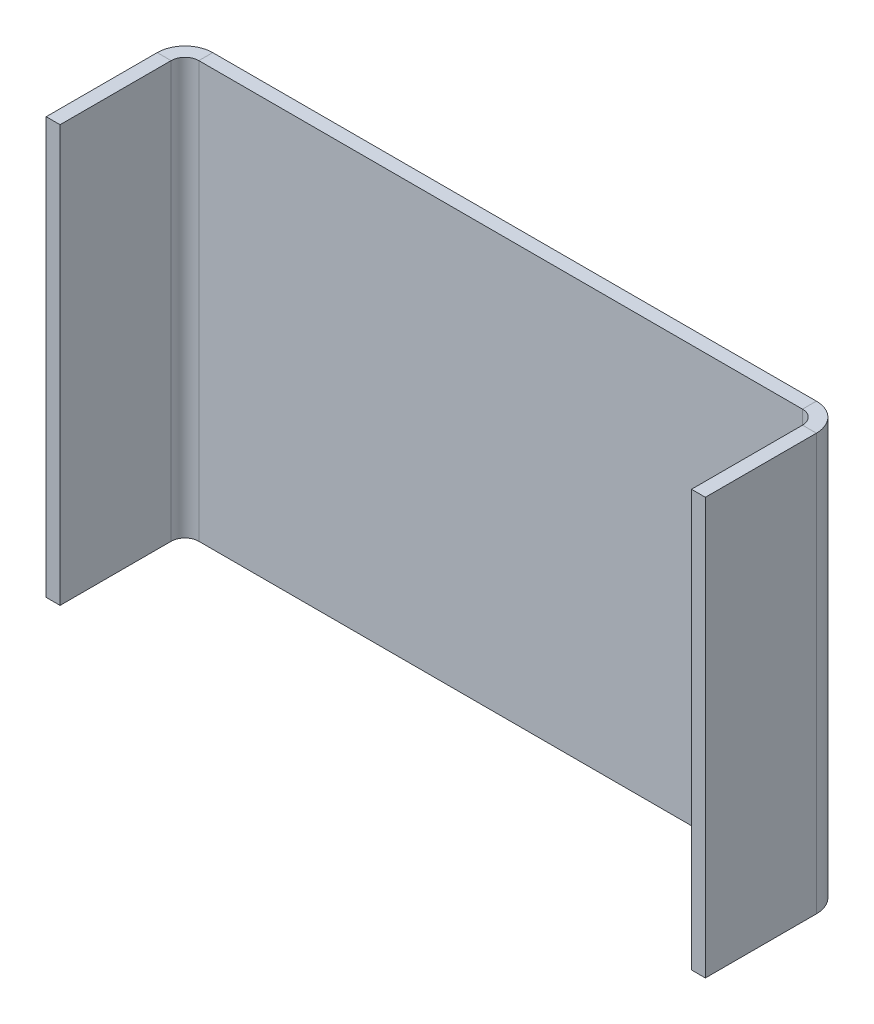
ISO-10303-21;
HEADER;
FILE_DESCRIPTION(('STEP AP214'),'2;1');
FILE_NAME('part.step','',(''),(''),'','','');
FILE_SCHEMA(('AUTOMOTIVE_DESIGN { 1 0 10303 214 1 1 1 1 }'));
ENDSEC;
DATA;
#1=APPLICATION_CONTEXT('core data for automotive mechanical design processes');
#2=APPLICATION_PROTOCOL_DEFINITION('international standard','automotive_design',2000,#1);
#3=PRODUCT_CONTEXT('',#1,'mechanical');
#4=PRODUCT('Part','Part','',(#3));
#5=PRODUCT_RELATED_PRODUCT_CATEGORY('part','',(#4));
#6=PRODUCT_DEFINITION_FORMATION('','',#4);
#7=PRODUCT_DEFINITION_CONTEXT('part definition',#1,'design');
#8=PRODUCT_DEFINITION('design','',#6,#7);
#9=PRODUCT_DEFINITION_SHAPE('','',#8);
#10=(LENGTH_UNIT() NAMED_UNIT(*) SI_UNIT(.MILLI.,.METRE.));
#11=(NAMED_UNIT(*) PLANE_ANGLE_UNIT() SI_UNIT($,.RADIAN.));
#12=(NAMED_UNIT(*) SI_UNIT($,.STERADIAN.) SOLID_ANGLE_UNIT());
#13=UNCERTAINTY_MEASURE_WITH_UNIT(LENGTH_MEASURE(1.E-05),#10,'distance_accuracy_value','');
#14=(GEOMETRIC_REPRESENTATION_CONTEXT(3) GLOBAL_UNCERTAINTY_ASSIGNED_CONTEXT((#13)) GLOBAL_UNIT_ASSIGNED_CONTEXT((#10,
#11,#12)) REPRESENTATION_CONTEXT('',''));
#15=CARTESIAN_POINT('',(0.,0.,0.));
#16=DIRECTION('',(0.,0.,1.));
#17=DIRECTION('',(1.,0.,0.));
#18=AXIS2_PLACEMENT_3D('',#15,#16,#17);
#19=CARTESIAN_POINT('',(95.,0.,0.));
#20=DIRECTION('',(0.,1.,0.));
#21=DIRECTION('',(1.,0.,0.));
#22=AXIS2_PLACEMENT_3D('',#19,#20,#21);
#23=PLANE('',#22);
#24=DIRECTION('',(0.,0.,-1.));
#25=VECTOR('',#24,1.);
#26=CARTESIAN_POINT('',(91.,0.,0.));
#27=LINE('',#26,#25);
#28=CARTESIAN_POINT('',(91.,0.,2.));
#29=VERTEX_POINT('',#28);
#30=CARTESIAN_POINT('',(91.,0.,0.));
#31=VERTEX_POINT('',#30);
#32=EDGE_CURVE('E11',#29,#31,#27,.T.);
#33=ORIENTED_EDGE('',*,*,#32,.F.);
#34=DIRECTION('',(-1.,0.,0.));
#35=VECTOR('',#34,1.);
#36=CARTESIAN_POINT('',(0.,0.,2.));
#37=LINE('',#36,#35);
#38=CARTESIAN_POINT('',(4.,0.,2.));
#39=VERTEX_POINT('',#38);
#40=EDGE_CURVE('E148',#39,#29,#37,.F.);
#41=ORIENTED_EDGE('',*,*,#40,.F.);
#42=DIRECTION('',(0.,0.,-1.));
#43=VECTOR('',#42,1.);
#44=CARTESIAN_POINT('',(4.,0.,0.));
#45=LINE('',#44,#43);
#46=CARTESIAN_POINT('',(4.,0.,0.));
#47=VERTEX_POINT('',#46);
#48=EDGE_CURVE('E48',#39,#47,#45,.T.);
#49=ORIENTED_EDGE('',*,*,#48,.T.);
#50=DIRECTION('',(1.,0.,0.));
#51=VECTOR('',#50,1.);
#52=CARTESIAN_POINT('',(95.,0.,0.));
#53=LINE('',#52,#51);
#54=EDGE_CURVE('E250',#47,#31,#53,.T.);
#55=ORIENTED_EDGE('',*,*,#54,.T.);
#56=EDGE_LOOP('',(#33,#41,#49,#55));
#57=FACE_BOUND('',#56,.T.);
#58=ADVANCED_FACE('F38',(#57),#23,.F.);
#59=CARTESIAN_POINT('',(4.,0.,4.));
#60=DIRECTION('',(0.,1.,0.));
#61=DIRECTION('',(-1.,0.,0.));
#62=AXIS2_PLACEMENT_3D('',#59,#60,#61);
#63=PLANE('',#62);
#64=ORIENTED_EDGE('',*,*,#48,.F.);
#65=CARTESIAN_POINT('',(4.,0.,4.));
#66=DIRECTION('',(0.,1.,0.));
#67=DIRECTION('',(0.,0.,1.));
#68=AXIS2_PLACEMENT_3D('',#65,#66,#67);
#69=CIRCLE('',#68,2.);
#70=CARTESIAN_POINT('',(2.,0.,4.));
#71=VERTEX_POINT('',#70);
#72=EDGE_CURVE('E151',#39,#71,#69,.T.);
#73=ORIENTED_EDGE('',*,*,#72,.T.);
#74=DIRECTION('',(-1.,0.,0.));
#75=VECTOR('',#74,1.);
#76=CARTESIAN_POINT('',(0.,0.,4.));
#77=LINE('',#76,#75);
#78=CARTESIAN_POINT('',(0.,0.,4.));
#79=VERTEX_POINT('',#78);
#80=EDGE_CURVE('E184',#71,#79,#77,.T.);
#81=ORIENTED_EDGE('',*,*,#80,.T.);
#82=CARTESIAN_POINT('',(4.,0.,4.));
#83=DIRECTION('',(0.,-1.,0.));
#84=DIRECTION('',(1.,0.,0.));
#85=AXIS2_PLACEMENT_3D('',#82,#83,#84);
#86=CIRCLE('',#85,4.);
#87=EDGE_CURVE('E192',#47,#79,#86,.F.);
#88=ORIENTED_EDGE('',*,*,#87,.F.);
#89=EDGE_LOOP('',(#64,#73,#81,#88));
#90=FACE_BOUND('',#89,.T.);
#91=ADVANCED_FACE('F191',(#90),#63,.F.);
#92=CARTESIAN_POINT('',(0.,0.,20.));
#93=DIRECTION('',(0.,-1.,0.));
#94=DIRECTION('',(0.,0.,-1.));
#95=AXIS2_PLACEMENT_3D('',#92,#93,#94);
#96=PLANE('',#95);
#97=ORIENTED_EDGE('',*,*,#80,.F.);
#98=DIRECTION('',(0.,0.,-1.));
#99=VECTOR('',#98,1.);
#100=CARTESIAN_POINT('',(2.,0.,20.));
#101=LINE('',#100,#99);
#102=CARTESIAN_POINT('',(2.,0.,20.));
#103=VERTEX_POINT('',#102);
#104=EDGE_CURVE('E129',#103,#71,#101,.T.);
#105=ORIENTED_EDGE('',*,*,#104,.F.);
#106=DIRECTION('',(-1.,0.,0.));
#107=VECTOR('',#106,1.);
#108=CARTESIAN_POINT('',(0.,0.,20.));
#109=LINE('',#108,#107);
#110=CARTESIAN_POINT('',(0.,0.,20.));
#111=VERTEX_POINT('',#110);
#112=EDGE_CURVE('E181',#103,#111,#109,.T.);
#113=ORIENTED_EDGE('',*,*,#112,.T.);
#114=DIRECTION('',(0.,0.,-1.));
#115=VECTOR('',#114,1.);
#116=CARTESIAN_POINT('',(0.,0.,20.));
#117=LINE('',#116,#115);
#118=EDGE_CURVE('E212',#111,#79,#117,.T.);
#119=ORIENTED_EDGE('',*,*,#118,.T.);
#120=EDGE_LOOP('',(#97,#105,#113,#119));
#121=FACE_BOUND('',#120,.T.);
#122=ADVANCED_FACE('F213',(#121),#96,.T.);
#123=CARTESIAN_POINT('',(0.,0.,20.));
#124=DIRECTION('',(0.,0.,1.));
#125=DIRECTION('',(0.,-1.,0.));
#126=AXIS2_PLACEMENT_3D('',#123,#124,#125);
#127=PLANE('',#126);
#128=ORIENTED_EDGE('',*,*,#112,.F.);
#129=DIRECTION('',(0.,1.,0.));
#130=VECTOR('',#129,1.);
#131=CARTESIAN_POINT('',(2.,0.,20.));
#132=LINE('',#131,#130);
#133=CARTESIAN_POINT('',(2.,60.,20.));
#134=VERTEX_POINT('',#133);
#135=EDGE_CURVE('E155',#134,#103,#132,.F.);
#136=ORIENTED_EDGE('',*,*,#135,.F.);
#137=DIRECTION('',(-1.,0.,0.));
#138=VECTOR('',#137,1.);
#139=CARTESIAN_POINT('',(0.,60.,20.));
#140=LINE('',#139,#138);
#141=CARTESIAN_POINT('',(0.,60.,20.));
#142=VERTEX_POINT('',#141);
#143=EDGE_CURVE('E178',#134,#142,#140,.T.);
#144=ORIENTED_EDGE('',*,*,#143,.T.);
#145=DIRECTION('',(0.,-1.,0.));
#146=VECTOR('',#145,1.);
#147=CARTESIAN_POINT('',(0.,0.,20.));
#148=LINE('',#147,#146);
#149=EDGE_CURVE('E217',#142,#111,#148,.T.);
#150=ORIENTED_EDGE('',*,*,#149,.T.);
#151=EDGE_LOOP('',(#128,#136,#144,#150));
#152=FACE_BOUND('',#151,.T.);
#153=ADVANCED_FACE('F246',(#152),#127,.T.);
#154=CARTESIAN_POINT('',(0.,60.,20.));
#155=DIRECTION('',(0.,-1.,0.));
#156=DIRECTION('',(0.,0.,-1.));
#157=AXIS2_PLACEMENT_3D('',#154,#155,#156);
#158=PLANE('',#157);
#159=ORIENTED_EDGE('',*,*,#143,.F.);
#160=DIRECTION('',(0.,0.,-1.));
#161=VECTOR('',#160,1.);
#162=CARTESIAN_POINT('',(2.,60.,20.));
#163=LINE('',#162,#161);
#164=CARTESIAN_POINT('',(2.,60.,4.));
#165=VERTEX_POINT('',#164);
#166=EDGE_CURVE('E152',#134,#165,#163,.T.);
#167=ORIENTED_EDGE('',*,*,#166,.T.);
#168=DIRECTION('',(-1.,0.,0.));
#169=VECTOR('',#168,1.);
#170=CARTESIAN_POINT('',(0.,60.,4.));
#171=LINE('',#170,#169);
#172=CARTESIAN_POINT('',(0.,60.,4.));
#173=VERTEX_POINT('',#172);
#174=EDGE_CURVE('E175',#165,#173,#171,.T.);
#175=ORIENTED_EDGE('',*,*,#174,.T.);
#176=DIRECTION('',(0.,0.,-1.));
#177=VECTOR('',#176,1.);
#178=CARTESIAN_POINT('',(0.,60.,20.));
#179=LINE('',#178,#177);
#180=EDGE_CURVE('E222',#142,#173,#179,.T.);
#181=ORIENTED_EDGE('',*,*,#180,.F.);
#182=EDGE_LOOP('',(#159,#167,#175,#181));
#183=FACE_BOUND('',#182,.T.);
#184=ADVANCED_FACE('F297',(#183),#158,.F.);
#185=CARTESIAN_POINT('',(4.,60.,4.));
#186=DIRECTION('',(0.,1.,0.));
#187=DIRECTION('',(0.,0.,1.));
#188=AXIS2_PLACEMENT_3D('',#185,#186,#187);
#189=PLANE('',#188);
#190=ORIENTED_EDGE('',*,*,#174,.F.);
#191=CARTESIAN_POINT('',(4.,60.,4.));
#192=DIRECTION('',(0.,1.,0.));
#193=DIRECTION('',(0.,0.,1.));
#194=AXIS2_PLACEMENT_3D('',#191,#192,#193);
#195=CIRCLE('',#194,2.);
#196=CARTESIAN_POINT('',(4.,60.,2.));
#197=VERTEX_POINT('',#196);
#198=EDGE_CURVE('E145',#165,#197,#195,.F.);
#199=ORIENTED_EDGE('',*,*,#198,.T.);
#200=DIRECTION('',(0.,0.,-1.));
#201=VECTOR('',#200,1.);
#202=CARTESIAN_POINT('',(4.,60.,0.));
#203=LINE('',#202,#201);
#204=CARTESIAN_POINT('',(4.,60.,0.));
#205=VERTEX_POINT('',#204);
#206=EDGE_CURVE('E173',#197,#205,#203,.T.);
#207=ORIENTED_EDGE('',*,*,#206,.T.);
#208=CARTESIAN_POINT('',(4.,60.,4.));
#209=DIRECTION('',(0.,-1.,0.));
#210=DIRECTION('',(0.,0.,-1.));
#211=AXIS2_PLACEMENT_3D('',#208,#209,#210);
#212=CIRCLE('',#211,4.);
#213=EDGE_CURVE('E208',#173,#205,#212,.T.);
#214=ORIENTED_EDGE('',*,*,#213,.F.);
#215=EDGE_LOOP('',(#190,#199,#207,#214));
#216=FACE_BOUND('',#215,.T.);
#217=ADVANCED_FACE('F299',(#216),#189,.T.);
#218=CARTESIAN_POINT('',(0.,60.,0.));
#219=DIRECTION('',(0.,-1.,0.));
#220=DIRECTION('',(-1.,0.,0.));
#221=AXIS2_PLACEMENT_3D('',#218,#219,#220);
#222=PLANE('',#221);
#223=ORIENTED_EDGE('',*,*,#206,.F.);
#224=DIRECTION('',(-1.,0.,0.));
#225=VECTOR('',#224,1.);
#226=CARTESIAN_POINT('',(0.,60.,2.));
#227=LINE('',#226,#225);
#228=CARTESIAN_POINT('',(91.,60.,2.));
#229=VERTEX_POINT('',#228);
#230=EDGE_CURVE('E143',#229,#197,#227,.T.);
#231=ORIENTED_EDGE('',*,*,#230,.F.);
#232=DIRECTION('',(0.,0.,-1.));
#233=VECTOR('',#232,1.);
#234=CARTESIAN_POINT('',(91.,60.,0.));
#235=LINE('',#234,#233);
#236=CARTESIAN_POINT('',(91.,60.,0.));
#237=VERTEX_POINT('',#236);
#238=EDGE_CURVE('E170',#229,#237,#235,.T.);
#239=ORIENTED_EDGE('',*,*,#238,.T.);
#240=DIRECTION('',(-1.,0.,0.));
#241=VECTOR('',#240,1.);
#242=CARTESIAN_POINT('',(0.,60.,0.));
#243=LINE('',#242,#241);
#244=EDGE_CURVE('E254',#237,#205,#243,.T.);
#245=ORIENTED_EDGE('',*,*,#244,.T.);
#246=EDGE_LOOP('',(#223,#231,#239,#245));
#247=FACE_BOUND('',#246,.T.);
#248=ADVANCED_FACE('F301',(#247),#222,.F.);
#249=CARTESIAN_POINT('',(91.,60.,4.));
#250=DIRECTION('',(0.,-1.,0.));
#251=DIRECTION('',(0.,0.,-1.));
#252=AXIS2_PLACEMENT_3D('',#249,#250,#251);
#253=PLANE('',#252);
#254=ORIENTED_EDGE('',*,*,#238,.F.);
#255=CARTESIAN_POINT('',(91.,60.,4.));
#256=DIRECTION('',(0.,-1.,0.));
#257=DIRECTION('',(0.,0.,-1.));
#258=AXIS2_PLACEMENT_3D('',#255,#256,#257);
#259=CIRCLE('',#258,2.);
#260=CARTESIAN_POINT('',(93.,60.,4.));
#261=VERTEX_POINT('',#260);
#262=EDGE_CURVE('E130',#229,#261,#259,.T.);
#263=ORIENTED_EDGE('',*,*,#262,.T.);
#264=DIRECTION('',(1.,0.,0.));
#265=VECTOR('',#264,1.);
#266=CARTESIAN_POINT('',(95.,60.,4.));
#267=LINE('',#266,#265);
#268=CARTESIAN_POINT('',(95.,60.,4.));
#269=VERTEX_POINT('',#268);
#270=EDGE_CURVE('E167',#261,#269,#267,.T.);
#271=ORIENTED_EDGE('',*,*,#270,.T.);
#272=CARTESIAN_POINT('',(91.,60.,4.));
#273=DIRECTION('',(0.,1.,0.));
#274=DIRECTION('',(0.,0.,1.));
#275=AXIS2_PLACEMENT_3D('',#272,#273,#274);
#276=CIRCLE('',#275,4.);
#277=EDGE_CURVE('E233',#237,#269,#276,.F.);
#278=ORIENTED_EDGE('',*,*,#277,.F.);
#279=EDGE_LOOP('',(#254,#263,#271,#278));
#280=FACE_BOUND('',#279,.T.);
#281=ADVANCED_FACE('F281',(#280),#253,.F.);
#282=CARTESIAN_POINT('',(95.,60.,20.));
#283=DIRECTION('',(0.,1.,0.));
#284=DIRECTION('',(0.,0.,-1.));
#285=AXIS2_PLACEMENT_3D('',#282,#283,#284);
#286=PLANE('',#285);
#287=ORIENTED_EDGE('',*,*,#270,.F.);
#288=DIRECTION('',(0.,0.,1.));
#289=VECTOR('',#288,1.);
#290=CARTESIAN_POINT('',(93.,60.,20.));
#291=LINE('',#290,#289);
#292=CARTESIAN_POINT('',(93.,60.,20.));
#293=VERTEX_POINT('',#292);
#294=EDGE_CURVE('E120',#293,#261,#291,.F.);
#295=ORIENTED_EDGE('',*,*,#294,.F.);
#296=DIRECTION('',(1.,0.,0.));
#297=VECTOR('',#296,1.);
#298=CARTESIAN_POINT('',(95.,60.,20.));
#299=LINE('',#298,#297);
#300=CARTESIAN_POINT('',(95.,60.,20.));
#301=VERTEX_POINT('',#300);
#302=EDGE_CURVE('E164',#293,#301,#299,.T.);
#303=ORIENTED_EDGE('',*,*,#302,.T.);
#304=DIRECTION('',(0.,0.,-1.));
#305=VECTOR('',#304,1.);
#306=CARTESIAN_POINT('',(95.,60.,20.));
#307=LINE('',#306,#305);
#308=EDGE_CURVE('E257',#301,#269,#307,.T.);
#309=ORIENTED_EDGE('',*,*,#308,.T.);
#310=EDGE_LOOP('',(#287,#295,#303,#309));
#311=FACE_BOUND('',#310,.T.);
#312=ADVANCED_FACE('F285',(#311),#286,.T.);
#313=CARTESIAN_POINT('',(95.,60.,20.));
#314=DIRECTION('',(0.,0.,1.));
#315=DIRECTION('',(0.,1.,0.));
#316=AXIS2_PLACEMENT_3D('',#313,#314,#315);
#317=PLANE('',#316);
#318=ORIENTED_EDGE('',*,*,#302,.F.);
#319=DIRECTION('',(0.,1.,0.));
#320=VECTOR('',#319,1.);
#321=CARTESIAN_POINT('',(93.,60.,20.));
#322=LINE('',#321,#320);
#323=CARTESIAN_POINT('',(93.,0.,20.));
#324=VERTEX_POINT('',#323);
#325=EDGE_CURVE('E135',#324,#293,#322,.T.);
#326=ORIENTED_EDGE('',*,*,#325,.F.);
#327=DIRECTION('',(1.,0.,0.));
#328=VECTOR('',#327,1.);
#329=CARTESIAN_POINT('',(95.,0.,20.));
#330=LINE('',#329,#328);
#331=CARTESIAN_POINT('',(95.,0.,20.));
#332=VERTEX_POINT('',#331);
#333=EDGE_CURVE('E109',#324,#332,#330,.T.);
#334=ORIENTED_EDGE('',*,*,#333,.T.);
#335=DIRECTION('',(0.,1.,0.));
#336=VECTOR('',#335,1.);
#337=CARTESIAN_POINT('',(95.,60.,20.));
#338=LINE('',#337,#336);
#339=EDGE_CURVE('E260',#332,#301,#338,.T.);
#340=ORIENTED_EDGE('',*,*,#339,.T.);
#341=EDGE_LOOP('',(#318,#326,#334,#340));
#342=FACE_BOUND('',#341,.T.);
#343=ADVANCED_FACE('F332',(#342),#317,.T.);
#344=CARTESIAN_POINT('',(95.,0.,20.));
#345=DIRECTION('',(0.,1.,0.));
#346=DIRECTION('',(0.,0.,-1.));
#347=AXIS2_PLACEMENT_3D('',#344,#345,#346);
#348=PLANE('',#347);
#349=ORIENTED_EDGE('',*,*,#333,.F.);
#350=DIRECTION('',(0.,0.,1.));
#351=VECTOR('',#350,1.);
#352=CARTESIAN_POINT('',(93.,0.,20.));
#353=LINE('',#352,#351);
#354=CARTESIAN_POINT('',(93.,0.,4.));
#355=VERTEX_POINT('',#354);
#356=EDGE_CURVE('E118',#324,#355,#353,.F.);
#357=ORIENTED_EDGE('',*,*,#356,.T.);
#358=DIRECTION('',(1.,0.,0.));
#359=VECTOR('',#358,1.);
#360=CARTESIAN_POINT('',(95.,0.,4.));
#361=LINE('',#360,#359);
#362=CARTESIAN_POINT('',(95.,0.,4.));
#363=VERTEX_POINT('',#362);
#364=EDGE_CURVE('E42',#355,#363,#361,.T.);
#365=ORIENTED_EDGE('',*,*,#364,.T.);
#366=DIRECTION('',(0.,0.,-1.));
#367=VECTOR('',#366,1.);
#368=CARTESIAN_POINT('',(95.,0.,20.));
#369=LINE('',#368,#367);
#370=EDGE_CURVE('E263',#332,#363,#369,.T.);
#371=ORIENTED_EDGE('',*,*,#370,.F.);
#372=EDGE_LOOP('',(#349,#357,#365,#371));
#373=FACE_BOUND('',#372,.T.);
#374=ADVANCED_FACE('F132',(#373),#348,.F.);
#375=CARTESIAN_POINT('',(91.,0.,4.));
#376=DIRECTION('',(0.,-1.,0.));
#377=DIRECTION('',(1.,0.,0.));
#378=AXIS2_PLACEMENT_3D('',#375,#376,#377);
#379=PLANE('',#378);
#380=CARTESIAN_POINT('',(91.,0.,4.));
#381=DIRECTION('',(0.,-1.,0.));
#382=DIRECTION('',(0.,0.,-1.));
#383=AXIS2_PLACEMENT_3D('',#380,#381,#382);
#384=CIRCLE('',#383,2.);
#385=EDGE_CURVE('E101',#355,#29,#384,.F.);
#386=ORIENTED_EDGE('',*,*,#385,.T.);
#387=ORIENTED_EDGE('',*,*,#32,.T.);
#388=CARTESIAN_POINT('',(91.,0.,4.));
#389=DIRECTION('',(0.,1.,0.));
#390=DIRECTION('',(-1.,0.,0.));
#391=AXIS2_PLACEMENT_3D('',#388,#389,#390);
#392=CIRCLE('',#391,4.);
#393=EDGE_CURVE('E104',#363,#31,#392,.T.);
#394=ORIENTED_EDGE('',*,*,#393,.F.);
#395=ORIENTED_EDGE('',*,*,#364,.F.);
#396=EDGE_LOOP('',(#386,#387,#394,#395));
#397=FACE_BOUND('',#396,.T.);
#398=ADVANCED_FACE('F40',(#397),#379,.T.);
#399=CARTESIAN_POINT('',(95.,60.,20.));
#400=DIRECTION('',(-1.,0.,0.));
#401=DIRECTION('',(0.,0.,1.));
#402=AXIS2_PLACEMENT_3D('',#399,#400,#401);
#403=PLANE('',#402);
#404=ORIENTED_EDGE('',*,*,#370,.T.);
#405=DIRECTION('',(0.,1.,0.));
#406=VECTOR('',#405,1.);
#407=CARTESIAN_POINT('',(95.,60.,4.));
#408=LINE('',#407,#406);
#409=EDGE_CURVE('E228',#363,#269,#408,.T.);
#410=ORIENTED_EDGE('',*,*,#409,.T.);
#411=ORIENTED_EDGE('',*,*,#308,.F.);
#412=ORIENTED_EDGE('',*,*,#339,.F.);
#413=EDGE_LOOP('',(#404,#410,#411,#412));
#414=FACE_BOUND('',#413,.T.);
#415=ADVANCED_FACE('F290',(#414),#403,.F.);
#416=CARTESIAN_POINT('',(0.,0.,0.));
#417=DIRECTION('',(0.,0.,-1.));
#418=DIRECTION('',(-1.,0.,0.));
#419=AXIS2_PLACEMENT_3D('',#416,#417,#418);
#420=PLANE('',#419);
#421=ORIENTED_EDGE('',*,*,#54,.F.);
#422=DIRECTION('',(0.,-1.,0.));
#423=VECTOR('',#422,1.);
#424=CARTESIAN_POINT('',(4.,60.,0.));
#425=LINE('',#424,#423);
#426=EDGE_CURVE('E110',#47,#205,#425,.F.);
#427=ORIENTED_EDGE('',*,*,#426,.T.);
#428=ORIENTED_EDGE('',*,*,#244,.F.);
#429=DIRECTION('',(0.,1.,0.));
#430=VECTOR('',#429,1.);
#431=CARTESIAN_POINT('',(91.,0.,0.));
#432=LINE('',#431,#430);
#433=EDGE_CURVE('E224',#237,#31,#432,.F.);
#434=ORIENTED_EDGE('',*,*,#433,.T.);
#435=EDGE_LOOP('',(#421,#427,#428,#434));
#436=FACE_BOUND('',#435,.T.);
#437=ADVANCED_FACE('F277',(#436),#420,.T.);
#438=CARTESIAN_POINT('',(0.,0.,20.));
#439=DIRECTION('',(1.,0.,0.));
#440=DIRECTION('',(0.,0.,-1.));
#441=AXIS2_PLACEMENT_3D('',#438,#439,#440);
#442=PLANE('',#441);
#443=ORIENTED_EDGE('',*,*,#180,.T.);
#444=DIRECTION('',(0.,-1.,0.));
#445=VECTOR('',#444,1.);
#446=CARTESIAN_POINT('',(0.,0.,4.));
#447=LINE('',#446,#445);
#448=EDGE_CURVE('E206',#173,#79,#447,.T.);
#449=ORIENTED_EDGE('',*,*,#448,.T.);
#450=ORIENTED_EDGE('',*,*,#118,.F.);
#451=ORIENTED_EDGE('',*,*,#149,.F.);
#452=EDGE_LOOP('',(#443,#449,#450,#451));
#453=FACE_BOUND('',#452,.T.);
#454=ADVANCED_FACE('F220',(#453),#442,.F.);
#455=CARTESIAN_POINT('',(91.,60.,4.));
#456=DIRECTION('',(0.,-1.,0.));
#457=DIRECTION('',(0.,0.,-1.));
#458=AXIS2_PLACEMENT_3D('',#455,#456,#457);
#459=CYLINDRICAL_SURFACE('',#458,4.);
#460=ORIENTED_EDGE('',*,*,#393,.T.);
#461=ORIENTED_EDGE('',*,*,#433,.F.);
#462=ORIENTED_EDGE('',*,*,#277,.T.);
#463=ORIENTED_EDGE('',*,*,#409,.F.);
#464=EDGE_LOOP('',(#460,#461,#462,#463));
#465=FACE_BOUND('',#464,.T.);
#466=ADVANCED_FACE('F273',(#465),#459,.T.);
#467=CARTESIAN_POINT('',(4.,0.,4.));
#468=DIRECTION('',(0.,1.,0.));
#469=DIRECTION('',(0.,0.,1.));
#470=AXIS2_PLACEMENT_3D('',#467,#468,#469);
#471=CYLINDRICAL_SURFACE('',#470,4.);
#472=ORIENTED_EDGE('',*,*,#213,.T.);
#473=ORIENTED_EDGE('',*,*,#426,.F.);
#474=ORIENTED_EDGE('',*,*,#87,.T.);
#475=ORIENTED_EDGE('',*,*,#448,.F.);
#476=EDGE_LOOP('',(#472,#473,#474,#475));
#477=FACE_BOUND('',#476,.T.);
#478=ADVANCED_FACE('F204',(#477),#471,.T.);
#479=CARTESIAN_POINT('',(93.,60.,20.));
#480=DIRECTION('',(-1.,0.,0.));
#481=DIRECTION('',(0.,0.,1.));
#482=AXIS2_PLACEMENT_3D('',#479,#480,#481);
#483=PLANE('',#482);
#484=ORIENTED_EDGE('',*,*,#356,.F.);
#485=ORIENTED_EDGE('',*,*,#325,.T.);
#486=ORIENTED_EDGE('',*,*,#294,.T.);
#487=DIRECTION('',(0.,1.,0.));
#488=VECTOR('',#487,1.);
#489=CARTESIAN_POINT('',(93.,60.,4.));
#490=LINE('',#489,#488);
#491=EDGE_CURVE('E115',#355,#261,#490,.T.);
#492=ORIENTED_EDGE('',*,*,#491,.F.);
#493=EDGE_LOOP('',(#484,#485,#486,#492));
#494=FACE_BOUND('',#493,.T.);
#495=ADVANCED_FACE('F116',(#494),#483,.T.);
#496=CARTESIAN_POINT('',(0.,0.,2.));
#497=DIRECTION('',(0.,0.,-1.));
#498=DIRECTION('',(-1.,0.,0.));
#499=AXIS2_PLACEMENT_3D('',#496,#497,#498);
#500=PLANE('',#499);
#501=ORIENTED_EDGE('',*,*,#40,.T.);
#502=DIRECTION('',(0.,1.,0.));
#503=VECTOR('',#502,1.);
#504=CARTESIAN_POINT('',(91.,0.,2.));
#505=LINE('',#504,#503);
#506=EDGE_CURVE('E124',#229,#29,#505,.F.);
#507=ORIENTED_EDGE('',*,*,#506,.F.);
#508=ORIENTED_EDGE('',*,*,#230,.T.);
#509=DIRECTION('',(0.,1.,0.));
#510=VECTOR('',#509,1.);
#511=CARTESIAN_POINT('',(4.,0.,2.));
#512=LINE('',#511,#510);
#513=EDGE_CURVE('E209',#39,#197,#512,.T.);
#514=ORIENTED_EDGE('',*,*,#513,.F.);
#515=EDGE_LOOP('',(#501,#507,#508,#514));
#516=FACE_BOUND('',#515,.T.);
#517=ADVANCED_FACE('F303',(#516),#500,.F.);
#518=CARTESIAN_POINT('',(2.,0.,20.));
#519=DIRECTION('',(1.,0.,0.));
#520=DIRECTION('',(0.,0.,-1.));
#521=AXIS2_PLACEMENT_3D('',#518,#519,#520);
#522=PLANE('',#521);
#523=ORIENTED_EDGE('',*,*,#166,.F.);
#524=ORIENTED_EDGE('',*,*,#135,.T.);
#525=ORIENTED_EDGE('',*,*,#104,.T.);
#526=DIRECTION('',(0.,1.,0.));
#527=VECTOR('',#526,1.);
#528=CARTESIAN_POINT('',(2.,0.,4.));
#529=LINE('',#528,#527);
#530=EDGE_CURVE('E139',#165,#71,#529,.F.);
#531=ORIENTED_EDGE('',*,*,#530,.F.);
#532=EDGE_LOOP('',(#523,#524,#525,#531));
#533=FACE_BOUND('',#532,.T.);
#534=ADVANCED_FACE('F243',(#533),#522,.T.);
#535=CARTESIAN_POINT('',(91.,60.,4.));
#536=DIRECTION('',(0.,-1.,0.));
#537=DIRECTION('',(0.,0.,-1.));
#538=AXIS2_PLACEMENT_3D('',#535,#536,#537);
#539=CYLINDRICAL_SURFACE('',#538,2.);
#540=ORIENTED_EDGE('',*,*,#385,.F.);
#541=ORIENTED_EDGE('',*,*,#491,.T.);
#542=ORIENTED_EDGE('',*,*,#262,.F.);
#543=ORIENTED_EDGE('',*,*,#506,.T.);
#544=EDGE_LOOP('',(#540,#541,#542,#543));
#545=FACE_BOUND('',#544,.T.);
#546=ADVANCED_FACE('F126',(#545),#539,.F.);
#547=CARTESIAN_POINT('',(4.,0.,4.));
#548=DIRECTION('',(0.,1.,0.));
#549=DIRECTION('',(0.,0.,1.));
#550=AXIS2_PLACEMENT_3D('',#547,#548,#549);
#551=CYLINDRICAL_SURFACE('',#550,2.);
#552=ORIENTED_EDGE('',*,*,#198,.F.);
#553=ORIENTED_EDGE('',*,*,#530,.T.);
#554=ORIENTED_EDGE('',*,*,#72,.F.);
#555=ORIENTED_EDGE('',*,*,#513,.T.);
#556=EDGE_LOOP('',(#552,#553,#554,#555));
#557=FACE_BOUND('',#556,.T.);
#558=ADVANCED_FACE('F240',(#557),#551,.F.);
#559=CLOSED_SHELL('',(#58,#91,#122,#153,#184,#217,#248,#281,#312,#343,#374,#398,#415,#437,#454,
#466,#478,#495,#517,#534,#546,#558));
#560=MANIFOLD_SOLID_BREP('B2',#559);
#561=ADVANCED_BREP_SHAPE_REPRESENTATION('',(#18,#560),#14);
#562=SHAPE_DEFINITION_REPRESENTATION(#9,#561);
ENDSEC;
END-ISO-10303-21;
